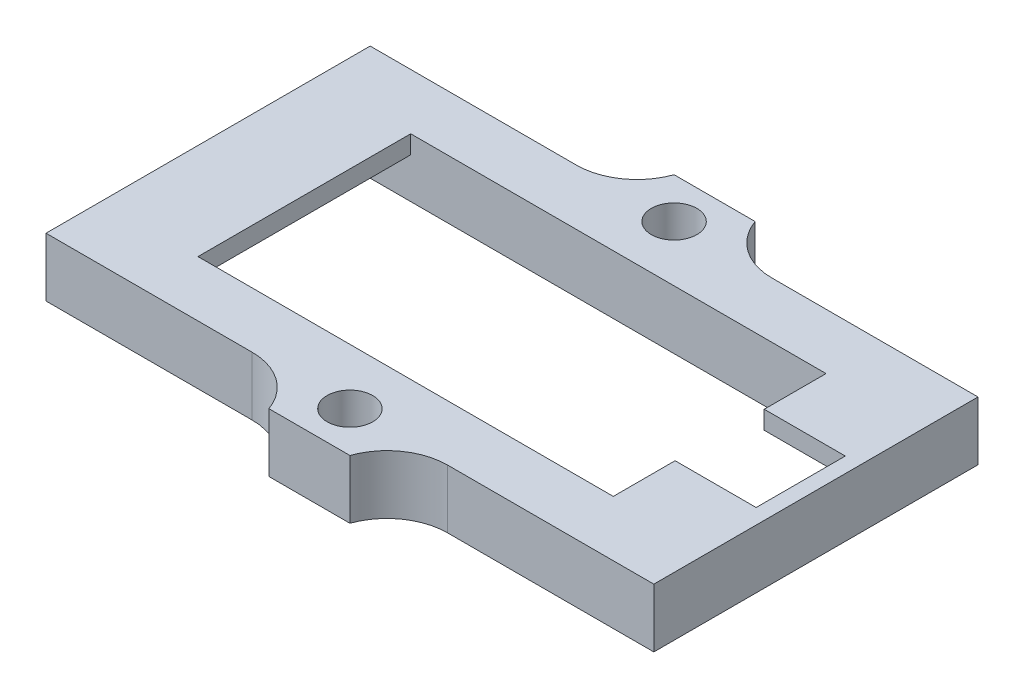
ISO-10303-21;
HEADER;
FILE_DESCRIPTION(('STEP AP214'),'2;1');
FILE_NAME('part.step','',(''),(''),'','','');
FILE_SCHEMA(('AUTOMOTIVE_DESIGN { 1 0 10303 214 1 1 1 1 }'));
ENDSEC;
DATA;
#1=APPLICATION_CONTEXT('core data for automotive mechanical design processes');
#2=APPLICATION_PROTOCOL_DEFINITION('international standard','automotive_design',2000,#1);
#3=PRODUCT_CONTEXT('',#1,'mechanical');
#4=PRODUCT('Part','Part','',(#3));
#5=PRODUCT_RELATED_PRODUCT_CATEGORY('part','',(#4));
#6=PRODUCT_DEFINITION_FORMATION('','',#4);
#7=PRODUCT_DEFINITION_CONTEXT('part definition',#1,'design');
#8=PRODUCT_DEFINITION('design','',#6,#7);
#9=PRODUCT_DEFINITION_SHAPE('','',#8);
#10=(LENGTH_UNIT() NAMED_UNIT(*) SI_UNIT(.MILLI.,.METRE.));
#11=(NAMED_UNIT(*) PLANE_ANGLE_UNIT() SI_UNIT($,.RADIAN.));
#12=(NAMED_UNIT(*) SI_UNIT($,.STERADIAN.) SOLID_ANGLE_UNIT());
#13=UNCERTAINTY_MEASURE_WITH_UNIT(LENGTH_MEASURE(1.E-05),#10,'distance_accuracy_value','');
#14=(GEOMETRIC_REPRESENTATION_CONTEXT(3) GLOBAL_UNCERTAINTY_ASSIGNED_CONTEXT((#13)) GLOBAL_UNIT_ASSIGNED_CONTEXT((#10,
#11,#12)) REPRESENTATION_CONTEXT('',''));
#15=CARTESIAN_POINT('',(0.,0.,0.));
#16=DIRECTION('',(0.,0.,1.));
#17=DIRECTION('',(1.,0.,0.));
#18=AXIS2_PLACEMENT_3D('',#15,#16,#17);
#19=CARTESIAN_POINT('',(20.5,0.,10.5));
#20=DIRECTION('',(1.,0.,0.));
#21=DIRECTION('',(0.,0.,-1.));
#22=AXIS2_PLACEMENT_3D('',#19,#20,#21);
#23=PLANE('',#22);
#24=DIRECTION('',(0.,0.,1.));
#25=VECTOR('',#24,1.);
#26=CARTESIAN_POINT('',(20.5,4.,10.5));
#27=LINE('',#26,#25);
#28=CARTESIAN_POINT('',(20.5,4.,-10.5));
#29=VERTEX_POINT('',#28);
#30=CARTESIAN_POINT('',(20.5,4.,-4.4));
#31=VERTEX_POINT('',#30);
#32=EDGE_CURVE('E271',#29,#31,#27,.T.);
#33=ORIENTED_EDGE('',*,*,#32,.T.);
#34=DIRECTION('',(0.,1.,0.));
#35=VECTOR('',#34,1.);
#36=CARTESIAN_POINT('',(20.5,0.,-4.4));
#37=LINE('',#36,#35);
#38=CARTESIAN_POINT('',(20.5,5.8,-4.4));
#39=VERTEX_POINT('',#38);
#40=EDGE_CURVE('E500',#31,#39,#37,.T.);
#41=ORIENTED_EDGE('',*,*,#40,.T.);
#42=DIRECTION('',(0.,0.,-1.));
#43=VECTOR('',#42,1.);
#44=CARTESIAN_POINT('',(20.5,5.8,10.5));
#45=LINE('',#44,#43);
#46=CARTESIAN_POINT('',(20.5,5.8,-10.5));
#47=VERTEX_POINT('',#46);
#48=EDGE_CURVE('E275',#39,#47,#45,.T.);
#49=ORIENTED_EDGE('',*,*,#48,.T.);
#50=DIRECTION('',(0.,1.,0.));
#51=VECTOR('',#50,1.);
#52=CARTESIAN_POINT('',(20.5,0.,-10.5));
#53=LINE('',#52,#51);
#54=EDGE_CURVE('E283',#29,#47,#53,.T.);
#55=ORIENTED_EDGE('',*,*,#54,.F.);
#56=EDGE_LOOP('',(#33,#41,#49,#55));
#57=FACE_BOUND('',#56,.T.);
#58=ADVANCED_FACE('F40',(#57),#23,.F.);
#59=CARTESIAN_POINT('',(0.,4.,0.));
#60=DIRECTION('',(0.,1.,0.));
#61=DIRECTION('',(0.,0.,1.));
#62=AXIS2_PLACEMENT_3D('',#59,#60,#61);
#63=PLANE('',#62);
#64=DIRECTION('',(0.,0.,1.));
#65=VECTOR('',#64,1.);
#66=CARTESIAN_POINT('',(28.5,4.,-10.5));
#67=LINE('',#66,#65);
#68=CARTESIAN_POINT('',(28.5,4.,-10.5));
#69=VERTEX_POINT('',#68);
#70=CARTESIAN_POINT('',(28.5,4.,-4.4));
#71=VERTEX_POINT('',#70);
#72=EDGE_CURVE('E226',#69,#71,#67,.T.);
#73=ORIENTED_EDGE('',*,*,#72,.T.);
#74=DIRECTION('',(1.,0.,0.));
#75=VECTOR('',#74,1.);
#76=CARTESIAN_POINT('',(12.5,4.,-4.4));
#77=LINE('',#76,#75);
#78=EDGE_CURVE('E56',#31,#71,#77,.T.);
#79=ORIENTED_EDGE('',*,*,#78,.F.);
#80=ORIENTED_EDGE('',*,*,#32,.F.);
#81=DIRECTION('',(1.,0.,0.));
#82=VECTOR('',#81,1.);
#83=CARTESIAN_POINT('',(-28.5,4.,-10.5));
#84=LINE('',#83,#82);
#85=EDGE_CURVE('E247',#29,#69,#84,.T.);
#86=ORIENTED_EDGE('',*,*,#85,.T.);
#87=EDGE_LOOP('',(#73,#79,#80,#86));
#88=FACE_BOUND('',#87,.T.);
#89=ADVANCED_FACE('F517',(#88),#63,.F.);
#90=CARTESIAN_POINT('',(0.,5.8,16.));
#91=DIRECTION('',(0.,0.,-1.));
#92=DIRECTION('',(-1.,0.,0.));
#93=AXIS2_PLACEMENT_3D('',#90,#91,#92);
#94=PLANE('',#93);
#95=DIRECTION('',(1.,0.,0.));
#96=VECTOR('',#95,1.);
#97=CARTESIAN_POINT('',(0.,0.,16.));
#98=LINE('',#97,#96);
#99=CARTESIAN_POINT('',(-30.,0.,16.));
#100=VERTEX_POINT('',#99);
#101=CARTESIAN_POINT('',(-9.65685424949239,0.,16.));
#102=VERTEX_POINT('',#101);
#103=EDGE_CURVE('E349',#100,#102,#98,.T.);
#104=ORIENTED_EDGE('',*,*,#103,.T.);
#105=DIRECTION('',(0.,1.,0.));
#106=VECTOR('',#105,1.);
#107=CARTESIAN_POINT('',(-9.65685424949239,5.8,16.));
#108=LINE('',#107,#106);
#109=CARTESIAN_POINT('',(-9.65685424949239,5.8,16.));
#110=VERTEX_POINT('',#109);
#111=EDGE_CURVE('E413',#102,#110,#108,.T.);
#112=ORIENTED_EDGE('',*,*,#111,.T.);
#113=DIRECTION('',(1.,0.,0.));
#114=VECTOR('',#113,1.);
#115=CARTESIAN_POINT('',(0.,5.8,16.));
#116=LINE('',#115,#114);
#117=CARTESIAN_POINT('',(-30.,5.8,16.));
#118=VERTEX_POINT('',#117);
#119=EDGE_CURVE('E316',#118,#110,#116,.T.);
#120=ORIENTED_EDGE('',*,*,#119,.F.);
#121=DIRECTION('',(0.,-1.,0.));
#122=VECTOR('',#121,1.);
#123=CARTESIAN_POINT('',(-30.,5.8,16.));
#124=LINE('',#123,#122);
#125=EDGE_CURVE('E345',#118,#100,#124,.T.);
#126=ORIENTED_EDGE('',*,*,#125,.T.);
#127=EDGE_LOOP('',(#104,#112,#120,#126));
#128=FACE_BOUND('',#127,.T.);
#129=ADVANCED_FACE('F551',(#128),#94,.F.);
#130=CARTESIAN_POINT('',(0.,5.8,20.));
#131=DIRECTION('',(0.,0.,-1.));
#132=DIRECTION('',(-1.,0.,0.));
#133=AXIS2_PLACEMENT_3D('',#130,#131,#132);
#134=PLANE('',#133);
#135=DIRECTION('',(1.,0.,0.));
#136=VECTOR('',#135,1.);
#137=CARTESIAN_POINT('',(0.,0.,20.));
#138=LINE('',#137,#136);
#139=CARTESIAN_POINT('',(-4.00000000000001,0.,20.));
#140=VERTEX_POINT('',#139);
#141=CARTESIAN_POINT('',(3.99999999999999,0.,20.));
#142=VERTEX_POINT('',#141);
#143=EDGE_CURVE('E353',#140,#142,#138,.T.);
#144=ORIENTED_EDGE('',*,*,#143,.T.);
#145=DIRECTION('',(0.,-1.,0.));
#146=VECTOR('',#145,1.);
#147=CARTESIAN_POINT('',(3.99999999999999,5.8,20.));
#148=LINE('',#147,#146);
#149=CARTESIAN_POINT('',(3.99999999999999,5.8,20.));
#150=VERTEX_POINT('',#149);
#151=EDGE_CURVE('E398',#150,#142,#148,.T.);
#152=ORIENTED_EDGE('',*,*,#151,.F.);
#153=DIRECTION('',(1.,0.,0.));
#154=VECTOR('',#153,1.);
#155=CARTESIAN_POINT('',(0.,5.8,20.));
#156=LINE('',#155,#154);
#157=CARTESIAN_POINT('',(-4.00000000000001,5.8,20.));
#158=VERTEX_POINT('',#157);
#159=EDGE_CURVE('E321',#158,#150,#156,.T.);
#160=ORIENTED_EDGE('',*,*,#159,.F.);
#161=DIRECTION('',(0.,-1.,0.));
#162=VECTOR('',#161,1.);
#163=CARTESIAN_POINT('',(-4.00000000000001,5.8,20.));
#164=LINE('',#163,#162);
#165=EDGE_CURVE('E402',#158,#140,#164,.T.);
#166=ORIENTED_EDGE('',*,*,#165,.T.);
#167=EDGE_LOOP('',(#144,#152,#160,#166));
#168=FACE_BOUND('',#167,.T.);
#169=ADVANCED_FACE('F449',(#168),#134,.F.);
#170=CARTESIAN_POINT('',(9.65685424949237,5.8,16.));
#171=VERTEX_POINT('',#170);
#172=CARTESIAN_POINT('',(30.,5.8,16.));
#173=VERTEX_POINT('',#172);
#174=EDGE_CURVE('E322',#171,#173,#116,.T.);
#175=ORIENTED_EDGE('',*,*,#174,.F.);
#176=DIRECTION('',(0.,1.,0.));
#177=VECTOR('',#176,1.);
#178=CARTESIAN_POINT('',(9.65685424949237,5.8,16.));
#179=LINE('',#178,#177);
#180=CARTESIAN_POINT('',(9.65685424949237,0.,16.));
#181=VERTEX_POINT('',#180);
#182=EDGE_CURVE('E416',#171,#181,#179,.F.);
#183=ORIENTED_EDGE('',*,*,#182,.T.);
#184=CARTESIAN_POINT('',(30.,0.,16.));
#185=VERTEX_POINT('',#184);
#186=EDGE_CURVE('E354',#181,#185,#98,.T.);
#187=ORIENTED_EDGE('',*,*,#186,.T.);
#188=DIRECTION('',(0.,-1.,0.));
#189=VECTOR('',#188,1.);
#190=CARTESIAN_POINT('',(30.,5.8,16.));
#191=LINE('',#190,#189);
#192=EDGE_CURVE('E394',#173,#185,#191,.T.);
#193=ORIENTED_EDGE('',*,*,#192,.F.);
#194=EDGE_LOOP('',(#175,#183,#187,#193));
#195=FACE_BOUND('',#194,.T.);
#196=ADVANCED_FACE('F459',(#195),#94,.F.);
#197=CARTESIAN_POINT('',(30.,5.8,0.));
#198=DIRECTION('',(-1.,0.,0.));
#199=DIRECTION('',(0.,0.,1.));
#200=AXIS2_PLACEMENT_3D('',#197,#198,#199);
#201=PLANE('',#200);
#202=DIRECTION('',(0.,0.,-1.));
#203=VECTOR('',#202,1.);
#204=CARTESIAN_POINT('',(30.,0.,0.));
#205=LINE('',#204,#203);
#206=CARTESIAN_POINT('',(30.,0.,-16.));
#207=VERTEX_POINT('',#206);
#208=EDGE_CURVE('E358',#185,#207,#205,.T.);
#209=ORIENTED_EDGE('',*,*,#208,.T.);
#210=DIRECTION('',(0.,-1.,0.));
#211=VECTOR('',#210,1.);
#212=CARTESIAN_POINT('',(30.,5.8,-16.));
#213=LINE('',#212,#211);
#214=CARTESIAN_POINT('',(30.,5.8,-16.));
#215=VERTEX_POINT('',#214);
#216=EDGE_CURVE('E390',#215,#207,#213,.T.);
#217=ORIENTED_EDGE('',*,*,#216,.F.);
#218=DIRECTION('',(0.,0.,-1.));
#219=VECTOR('',#218,1.);
#220=CARTESIAN_POINT('',(30.,5.8,0.));
#221=LINE('',#220,#219);
#222=EDGE_CURVE('E325',#173,#215,#221,.T.);
#223=ORIENTED_EDGE('',*,*,#222,.F.);
#224=ORIENTED_EDGE('',*,*,#192,.T.);
#225=EDGE_LOOP('',(#209,#217,#223,#224));
#226=FACE_BOUND('',#225,.T.);
#227=ADVANCED_FACE('F612',(#226),#201,.F.);
#228=CARTESIAN_POINT('',(0.,5.8,-16.));
#229=DIRECTION('',(0.,0.,-1.));
#230=DIRECTION('',(-1.,0.,0.));
#231=AXIS2_PLACEMENT_3D('',#228,#229,#230);
#232=PLANE('',#231);
#233=DIRECTION('',(1.,0.,0.));
#234=VECTOR('',#233,1.);
#235=CARTESIAN_POINT('',(0.,0.,-16.));
#236=LINE('',#235,#234);
#237=CARTESIAN_POINT('',(9.65685424949238,0.,-16.));
#238=VERTEX_POINT('',#237);
#239=EDGE_CURVE('E362',#238,#207,#236,.T.);
#240=ORIENTED_EDGE('',*,*,#239,.F.);
#241=DIRECTION('',(0.,1.,0.));
#242=VECTOR('',#241,1.);
#243=CARTESIAN_POINT('',(9.65685424949238,5.8,-16.));
#244=LINE('',#243,#242);
#245=CARTESIAN_POINT('',(9.65685424949238,5.8,-16.));
#246=VERTEX_POINT('',#245);
#247=EDGE_CURVE('E406',#238,#246,#244,.T.);
#248=ORIENTED_EDGE('',*,*,#247,.T.);
#249=DIRECTION('',(1.,0.,0.));
#250=VECTOR('',#249,1.);
#251=CARTESIAN_POINT('',(0.,5.8,-16.));
#252=LINE('',#251,#250);
#253=EDGE_CURVE('E329',#246,#215,#252,.T.);
#254=ORIENTED_EDGE('',*,*,#253,.T.);
#255=ORIENTED_EDGE('',*,*,#216,.T.);
#256=EDGE_LOOP('',(#240,#248,#254,#255));
#257=FACE_BOUND('',#256,.T.);
#258=ADVANCED_FACE('F609',(#257),#232,.T.);
#259=CARTESIAN_POINT('',(0.,5.8,-20.));
#260=DIRECTION('',(0.,0.,-1.));
#261=DIRECTION('',(-1.,0.,0.));
#262=AXIS2_PLACEMENT_3D('',#259,#260,#261);
#263=PLANE('',#262);
#264=DIRECTION('',(1.,0.,0.));
#265=VECTOR('',#264,1.);
#266=CARTESIAN_POINT('',(0.,0.,-20.));
#267=LINE('',#266,#265);
#268=CARTESIAN_POINT('',(-4.00000000000001,0.,-20.));
#269=VERTEX_POINT('',#268);
#270=CARTESIAN_POINT('',(3.99999999999999,0.,-20.));
#271=VERTEX_POINT('',#270);
#272=EDGE_CURVE('E365',#269,#271,#267,.T.);
#273=ORIENTED_EDGE('',*,*,#272,.F.);
#274=DIRECTION('',(0.,-1.,0.));
#275=VECTOR('',#274,1.);
#276=CARTESIAN_POINT('',(-4.00000000000001,5.8,-20.));
#277=LINE('',#276,#275);
#278=CARTESIAN_POINT('',(-4.00000000000001,5.8,-20.));
#279=VERTEX_POINT('',#278);
#280=EDGE_CURVE('E382',#279,#269,#277,.T.);
#281=ORIENTED_EDGE('',*,*,#280,.F.);
#282=DIRECTION('',(1.,0.,0.));
#283=VECTOR('',#282,1.);
#284=CARTESIAN_POINT('',(0.,5.8,-20.));
#285=LINE('',#284,#283);
#286=CARTESIAN_POINT('',(3.99999999999999,5.8,-20.));
#287=VERTEX_POINT('',#286);
#288=EDGE_CURVE('E332',#279,#287,#285,.T.);
#289=ORIENTED_EDGE('',*,*,#288,.T.);
#290=DIRECTION('',(0.,-1.,0.));
#291=VECTOR('',#290,1.);
#292=CARTESIAN_POINT('',(3.99999999999999,5.8,-20.));
#293=LINE('',#292,#291);
#294=EDGE_CURVE('E386',#287,#271,#293,.T.);
#295=ORIENTED_EDGE('',*,*,#294,.T.);
#296=EDGE_LOOP('',(#273,#281,#289,#295));
#297=FACE_BOUND('',#296,.T.);
#298=ADVANCED_FACE('F600',(#297),#263,.T.);
#299=CARTESIAN_POINT('',(-30.,5.8,-16.));
#300=VERTEX_POINT('',#299);
#301=CARTESIAN_POINT('',(-9.65685424949239,5.8,-16.));
#302=VERTEX_POINT('',#301);
#303=EDGE_CURVE('E333',#300,#302,#252,.T.);
#304=ORIENTED_EDGE('',*,*,#303,.T.);
#305=DIRECTION('',(0.,1.,0.));
#306=VECTOR('',#305,1.);
#307=CARTESIAN_POINT('',(-9.65685424949239,0.,-16.));
#308=LINE('',#307,#306);
#309=CARTESIAN_POINT('',(-9.65685424949239,0.,-16.));
#310=VERTEX_POINT('',#309);
#311=EDGE_CURVE('E409',#302,#310,#308,.F.);
#312=ORIENTED_EDGE('',*,*,#311,.T.);
#313=CARTESIAN_POINT('',(-30.,0.,-16.));
#314=VERTEX_POINT('',#313);
#315=EDGE_CURVE('E366',#314,#310,#236,.T.);
#316=ORIENTED_EDGE('',*,*,#315,.F.);
#317=DIRECTION('',(0.,-1.,0.));
#318=VECTOR('',#317,1.);
#319=CARTESIAN_POINT('',(-30.,5.8,-16.));
#320=LINE('',#319,#318);
#321=EDGE_CURVE('E379',#300,#314,#320,.T.);
#322=ORIENTED_EDGE('',*,*,#321,.F.);
#323=EDGE_LOOP('',(#304,#312,#316,#322));
#324=FACE_BOUND('',#323,.T.);
#325=ADVANCED_FACE('F539',(#324),#232,.T.);
#326=CARTESIAN_POINT('',(-30.,5.8,0.));
#327=DIRECTION('',(-1.,0.,0.));
#328=DIRECTION('',(0.,0.,1.));
#329=AXIS2_PLACEMENT_3D('',#326,#327,#328);
#330=PLANE('',#329);
#331=DIRECTION('',(0.,0.,-1.));
#332=VECTOR('',#331,1.);
#333=CARTESIAN_POINT('',(-30.,0.,0.));
#334=LINE('',#333,#332);
#335=EDGE_CURVE('E370',#100,#314,#334,.T.);
#336=ORIENTED_EDGE('',*,*,#335,.F.);
#337=ORIENTED_EDGE('',*,*,#125,.F.);
#338=DIRECTION('',(0.,0.,-1.));
#339=VECTOR('',#338,1.);
#340=CARTESIAN_POINT('',(-30.,5.8,0.));
#341=LINE('',#340,#339);
#342=EDGE_CURVE('E337',#118,#300,#341,.T.);
#343=ORIENTED_EDGE('',*,*,#342,.T.);
#344=ORIENTED_EDGE('',*,*,#321,.T.);
#345=EDGE_LOOP('',(#336,#337,#343,#344));
#346=FACE_BOUND('',#345,.T.);
#347=ADVANCED_FACE('F530',(#346),#330,.T.);
#348=CARTESIAN_POINT('',(0.,5.8,16.));
#349=DIRECTION('',(0.,-1.,0.));
#350=DIRECTION('',(0.,0.,-1.));
#351=AXIS2_PLACEMENT_3D('',#348,#349,#350);
#352=CYLINDRICAL_SURFACE('',#351,2.24999999999998);
#353=CARTESIAN_POINT('',(0.,5.8,16.));
#354=DIRECTION('',(0.,1.,0.));
#355=DIRECTION('',(0.,0.,1.));
#356=AXIS2_PLACEMENT_3D('',#353,#354,#355);
#357=CIRCLE('',#356,2.24999999999998);
#358=CARTESIAN_POINT('',(0.,5.8,18.25));
#359=VERTEX_POINT('',#358);
#360=EDGE_CURVE('E312',#359,#359,#357,.F.);
#361=ORIENTED_EDGE('',*,*,#360,.F.);
#362=EDGE_LOOP('',(#361));
#363=FACE_BOUND('',#362,.T.);
#364=CARTESIAN_POINT('',(0.,0.,16.));
#365=DIRECTION('',(0.,1.,0.));
#366=DIRECTION('',(0.,0.,1.));
#367=AXIS2_PLACEMENT_3D('',#364,#365,#366);
#368=CIRCLE('',#367,2.24999999999998);
#369=CARTESIAN_POINT('',(0.,0.,18.25));
#370=VERTEX_POINT('',#369);
#371=EDGE_CURVE('E302',#370,#370,#368,.F.);
#372=ORIENTED_EDGE('',*,*,#371,.T.);
#373=EDGE_LOOP('',(#372));
#374=FACE_BOUND('',#373,.T.);
#375=ADVANCED_FACE('F527',(#363,#374),#352,.F.);
#376=CARTESIAN_POINT('',(0.,5.8,-16.));
#377=DIRECTION('',(0.,-1.,0.));
#378=DIRECTION('',(0.,0.,-1.));
#379=AXIS2_PLACEMENT_3D('',#376,#377,#378);
#380=CYLINDRICAL_SURFACE('',#379,2.25);
#381=CARTESIAN_POINT('',(0.,5.8,-16.));
#382=DIRECTION('',(0.,1.,0.));
#383=DIRECTION('',(0.,0.,1.));
#384=AXIS2_PLACEMENT_3D('',#381,#382,#383);
#385=CIRCLE('',#384,2.25);
#386=CARTESIAN_POINT('',(0.,5.8,-13.75));
#387=VERTEX_POINT('',#386);
#388=EDGE_CURVE('E341',#387,#387,#385,.T.);
#389=ORIENTED_EDGE('',*,*,#388,.T.);
#390=EDGE_LOOP('',(#389));
#391=FACE_BOUND('',#390,.T.);
#392=CARTESIAN_POINT('',(0.,0.,-16.));
#393=DIRECTION('',(0.,1.,0.));
#394=DIRECTION('',(0.,0.,1.));
#395=AXIS2_PLACEMENT_3D('',#392,#393,#394);
#396=CIRCLE('',#395,2.25);
#397=CARTESIAN_POINT('',(0.,0.,-13.75));
#398=VERTEX_POINT('',#397);
#399=EDGE_CURVE('E317',#398,#398,#396,.T.);
#400=ORIENTED_EDGE('',*,*,#399,.F.);
#401=EDGE_LOOP('',(#400));
#402=FACE_BOUND('',#401,.T.);
#403=ADVANCED_FACE('F529',(#391,#402),#380,.F.);
#404=CARTESIAN_POINT('',(0.,5.8,0.));
#405=DIRECTION('',(0.,1.,0.));
#406=DIRECTION('',(0.,0.,1.));
#407=AXIS2_PLACEMENT_3D('',#404,#405,#406);
#408=PLANE('',#407);
#409=DIRECTION('',(-1.,0.,0.));
#410=VECTOR('',#409,1.);
#411=CARTESIAN_POINT('',(0.,5.8,-4.4));
#412=LINE('',#411,#410);
#413=CARTESIAN_POINT('',(28.5,5.8,-4.4));
#414=VERTEX_POINT('',#413);
#415=EDGE_CURVE('E506',#414,#39,#412,.T.);
#416=ORIENTED_EDGE('',*,*,#415,.F.);
#417=DIRECTION('',(0.,0.,-1.));
#418=VECTOR('',#417,1.);
#419=CARTESIAN_POINT('',(28.5,5.8,0.));
#420=LINE('',#419,#418);
#421=CARTESIAN_POINT('',(28.5,5.8,4.4));
#422=VERTEX_POINT('',#421);
#423=EDGE_CURVE('E238',#422,#414,#420,.T.);
#424=ORIENTED_EDGE('',*,*,#423,.F.);
#425=DIRECTION('',(1.,0.,0.));
#426=VECTOR('',#425,1.);
#427=CARTESIAN_POINT('',(0.,5.8,4.4));
#428=LINE('',#427,#426);
#429=CARTESIAN_POINT('',(20.5,5.8,4.4));
#430=VERTEX_POINT('',#429);
#431=EDGE_CURVE('E207',#430,#422,#428,.T.);
#432=ORIENTED_EDGE('',*,*,#431,.F.);
#433=CARTESIAN_POINT('',(20.5,5.8,10.5));
#434=VERTEX_POINT('',#433);
#435=EDGE_CURVE('E284',#434,#430,#45,.T.);
#436=ORIENTED_EDGE('',*,*,#435,.F.);
#437=DIRECTION('',(1.,0.,0.));
#438=VECTOR('',#437,1.);
#439=CARTESIAN_POINT('',(-20.5,5.8,10.5));
#440=LINE('',#439,#438);
#441=CARTESIAN_POINT('',(-20.5,5.8,10.5));
#442=VERTEX_POINT('',#441);
#443=EDGE_CURVE('E280',#442,#434,#440,.T.);
#444=ORIENTED_EDGE('',*,*,#443,.F.);
#445=DIRECTION('',(0.,0.,1.));
#446=VECTOR('',#445,1.);
#447=CARTESIAN_POINT('',(-20.5,5.8,10.5));
#448=LINE('',#447,#446);
#449=CARTESIAN_POINT('',(-20.5,5.8,-10.5));
#450=VERTEX_POINT('',#449);
#451=EDGE_CURVE('E292',#450,#442,#448,.T.);
#452=ORIENTED_EDGE('',*,*,#451,.F.);
#453=DIRECTION('',(-1.,0.,0.));
#454=VECTOR('',#453,1.);
#455=CARTESIAN_POINT('',(-20.5,5.8,-10.5));
#456=LINE('',#455,#454);
#457=EDGE_CURVE('E288',#47,#450,#456,.T.);
#458=ORIENTED_EDGE('',*,*,#457,.F.);
#459=ORIENTED_EDGE('',*,*,#48,.F.);
#460=EDGE_LOOP('',(#416,#424,#432,#436,#444,#452,#458,#459));
#461=FACE_BOUND('',#460,.T.);
#462=ORIENTED_EDGE('',*,*,#360,.T.);
#463=EDGE_LOOP('',(#462));
#464=FACE_BOUND('',#463,.T.);
#465=ORIENTED_EDGE('',*,*,#119,.T.);
#466=CARTESIAN_POINT('',(-9.65685424949239,5.8,22.));
#467=DIRECTION('',(0.,1.,0.));
#468=DIRECTION('',(0.,0.,1.));
#469=AXIS2_PLACEMENT_3D('',#466,#467,#468);
#470=CIRCLE('',#469,6.);
#471=EDGE_CURVE('E435',#110,#158,#470,.F.);
#472=ORIENTED_EDGE('',*,*,#471,.T.);
#473=ORIENTED_EDGE('',*,*,#159,.T.);
#474=CARTESIAN_POINT('',(9.65685424949237,5.8,22.));
#475=DIRECTION('',(0.,1.,0.));
#476=DIRECTION('',(0.,0.,1.));
#477=AXIS2_PLACEMENT_3D('',#474,#475,#476);
#478=CIRCLE('',#477,6.);
#479=EDGE_CURVE('E11',#150,#171,#478,.F.);
#480=ORIENTED_EDGE('',*,*,#479,.T.);
#481=ORIENTED_EDGE('',*,*,#174,.T.);
#482=ORIENTED_EDGE('',*,*,#222,.T.);
#483=ORIENTED_EDGE('',*,*,#253,.F.);
#484=CARTESIAN_POINT('',(9.65685424949238,5.8,-22.));
#485=DIRECTION('',(0.,1.,0.));
#486=DIRECTION('',(0.,0.,1.));
#487=AXIS2_PLACEMENT_3D('',#484,#485,#486);
#488=CIRCLE('',#487,6.);
#489=EDGE_CURVE('E423',#246,#287,#488,.F.);
#490=ORIENTED_EDGE('',*,*,#489,.T.);
#491=ORIENTED_EDGE('',*,*,#288,.F.);
#492=CARTESIAN_POINT('',(-9.65685424949239,5.8,-22.));
#493=DIRECTION('',(0.,1.,0.));
#494=DIRECTION('',(0.,0.,1.));
#495=AXIS2_PLACEMENT_3D('',#492,#493,#494);
#496=CIRCLE('',#495,6.);
#497=EDGE_CURVE('E429',#279,#302,#496,.F.);
#498=ORIENTED_EDGE('',*,*,#497,.T.);
#499=ORIENTED_EDGE('',*,*,#303,.F.);
#500=ORIENTED_EDGE('',*,*,#342,.F.);
#501=EDGE_LOOP('',(#465,#472,#473,#480,#481,#482,#483,#490,#491,#498,#499,#500));
#502=FACE_BOUND('',#501,.T.);
#503=ORIENTED_EDGE('',*,*,#388,.F.);
#504=EDGE_LOOP('',(#503));
#505=FACE_BOUND('',#504,.T.);
#506=ADVANCED_FACE('F455',(#461,#464,#502,#505),#408,.T.);
#507=CARTESIAN_POINT('',(0.,0.,0.));
#508=DIRECTION('',(0.,1.,0.));
#509=DIRECTION('',(0.,0.,1.));
#510=AXIS2_PLACEMENT_3D('',#507,#508,#509);
#511=PLANE('',#510);
#512=DIRECTION('',(-1.,0.,0.));
#513=VECTOR('',#512,1.);
#514=CARTESIAN_POINT('',(-20.5,0.,-10.5));
#515=LINE('',#514,#513);
#516=CARTESIAN_POINT('',(28.5,0.,-10.5));
#517=VERTEX_POINT('',#516);
#518=CARTESIAN_POINT('',(-28.5,0.,-10.5));
#519=VERTEX_POINT('',#518);
#520=EDGE_CURVE('E276',#517,#519,#515,.T.);
#521=ORIENTED_EDGE('',*,*,#520,.T.);
#522=DIRECTION('',(0.,0.,-1.));
#523=VECTOR('',#522,1.);
#524=CARTESIAN_POINT('',(-28.5,0.,-10.5));
#525=LINE('',#524,#523);
#526=CARTESIAN_POINT('',(-28.5,0.,10.5));
#527=VERTEX_POINT('',#526);
#528=EDGE_CURVE('E227',#527,#519,#525,.T.);
#529=ORIENTED_EDGE('',*,*,#528,.F.);
#530=DIRECTION('',(1.,0.,0.));
#531=VECTOR('',#530,1.);
#532=CARTESIAN_POINT('',(-20.5,0.,10.5));
#533=LINE('',#532,#531);
#534=CARTESIAN_POINT('',(28.5,0.,10.5));
#535=VERTEX_POINT('',#534);
#536=EDGE_CURVE('E279',#527,#535,#533,.T.);
#537=ORIENTED_EDGE('',*,*,#536,.T.);
#538=DIRECTION('',(0.,0.,1.));
#539=VECTOR('',#538,1.);
#540=CARTESIAN_POINT('',(28.5,0.,-10.5));
#541=LINE('',#540,#539);
#542=EDGE_CURVE('E234',#517,#535,#541,.T.);
#543=ORIENTED_EDGE('',*,*,#542,.F.);
#544=EDGE_LOOP('',(#521,#529,#537,#543));
#545=FACE_BOUND('',#544,.T.);
#546=ORIENTED_EDGE('',*,*,#371,.F.);
#547=EDGE_LOOP('',(#546));
#548=FACE_BOUND('',#547,.T.);
#549=ORIENTED_EDGE('',*,*,#103,.F.);
#550=ORIENTED_EDGE('',*,*,#335,.T.);
#551=ORIENTED_EDGE('',*,*,#315,.T.);
#552=CARTESIAN_POINT('',(-9.65685424949239,0.,-22.));
#553=DIRECTION('',(0.,1.,0.));
#554=DIRECTION('',(0.,0.,1.));
#555=AXIS2_PLACEMENT_3D('',#552,#553,#554);
#556=CIRCLE('',#555,6.);
#557=EDGE_CURVE('E426',#310,#269,#556,.T.);
#558=ORIENTED_EDGE('',*,*,#557,.T.);
#559=ORIENTED_EDGE('',*,*,#272,.T.);
#560=CARTESIAN_POINT('',(9.65685424949238,0.,-22.));
#561=DIRECTION('',(0.,1.,0.));
#562=DIRECTION('',(0.,0.,1.));
#563=AXIS2_PLACEMENT_3D('',#560,#561,#562);
#564=CIRCLE('',#563,6.);
#565=EDGE_CURVE('E420',#271,#238,#564,.T.);
#566=ORIENTED_EDGE('',*,*,#565,.T.);
#567=ORIENTED_EDGE('',*,*,#239,.T.);
#568=ORIENTED_EDGE('',*,*,#208,.F.);
#569=ORIENTED_EDGE('',*,*,#186,.F.);
#570=CARTESIAN_POINT('',(9.65685424949237,0.,22.));
#571=DIRECTION('',(0.,1.,0.));
#572=DIRECTION('',(0.,0.,1.));
#573=AXIS2_PLACEMENT_3D('',#570,#571,#572);
#574=CIRCLE('',#573,6.);
#575=EDGE_CURVE('E49',#181,#142,#574,.T.);
#576=ORIENTED_EDGE('',*,*,#575,.T.);
#577=ORIENTED_EDGE('',*,*,#143,.F.);
#578=CARTESIAN_POINT('',(-9.65685424949239,0.,22.));
#579=DIRECTION('',(0.,1.,0.));
#580=DIRECTION('',(0.,0.,1.));
#581=AXIS2_PLACEMENT_3D('',#578,#579,#580);
#582=CIRCLE('',#581,6.);
#583=EDGE_CURVE('E432',#140,#102,#582,.T.);
#584=ORIENTED_EDGE('',*,*,#583,.T.);
#585=EDGE_LOOP('',(#549,#550,#551,#558,#559,#566,#567,#568,#569,#576,#577,#584));
#586=FACE_BOUND('',#585,.T.);
#587=ORIENTED_EDGE('',*,*,#399,.T.);
#588=EDGE_LOOP('',(#587));
#589=FACE_BOUND('',#588,.T.);
#590=ADVANCED_FACE('F442',(#545,#548,#586,#589),#511,.F.);
#591=ORIENTED_EDGE('',*,*,#435,.T.);
#592=DIRECTION('',(0.,-1.,0.));
#593=VECTOR('',#592,1.);
#594=CARTESIAN_POINT('',(20.5,0.,4.4));
#595=LINE('',#594,#593);
#596=CARTESIAN_POINT('',(20.5,4.,4.4));
#597=VERTEX_POINT('',#596);
#598=EDGE_CURVE('E495',#430,#597,#595,.T.);
#599=ORIENTED_EDGE('',*,*,#598,.T.);
#600=CARTESIAN_POINT('',(20.5,4.,10.5));
#601=VERTEX_POINT('',#600);
#602=EDGE_CURVE('E64',#597,#601,#27,.T.);
#603=ORIENTED_EDGE('',*,*,#602,.T.);
#604=DIRECTION('',(0.,1.,0.));
#605=VECTOR('',#604,1.);
#606=CARTESIAN_POINT('',(20.5,0.,10.5));
#607=LINE('',#606,#605);
#608=EDGE_CURVE('E299',#601,#434,#607,.T.);
#609=ORIENTED_EDGE('',*,*,#608,.T.);
#610=EDGE_LOOP('',(#591,#599,#603,#609));
#611=FACE_BOUND('',#610,.T.);
#612=ADVANCED_FACE('F494',(#611),#23,.F.);
#613=CARTESIAN_POINT('',(-20.5,0.,10.5));
#614=DIRECTION('',(0.,0.,1.));
#615=DIRECTION('',(1.,0.,0.));
#616=AXIS2_PLACEMENT_3D('',#613,#614,#615);
#617=PLANE('',#616);
#618=ORIENTED_EDGE('',*,*,#608,.F.);
#619=DIRECTION('',(-1.,0.,0.));
#620=VECTOR('',#619,1.);
#621=CARTESIAN_POINT('',(-28.5,4.,10.5));
#622=LINE('',#621,#620);
#623=CARTESIAN_POINT('',(28.5,4.,10.5));
#624=VERTEX_POINT('',#623);
#625=EDGE_CURVE('E240',#624,#601,#622,.T.);
#626=ORIENTED_EDGE('',*,*,#625,.F.);
#627=DIRECTION('',(0.,-1.,0.));
#628=VECTOR('',#627,1.);
#629=CARTESIAN_POINT('',(28.5,4.,10.5));
#630=LINE('',#629,#628);
#631=EDGE_CURVE('E223',#624,#535,#630,.T.);
#632=ORIENTED_EDGE('',*,*,#631,.T.);
#633=ORIENTED_EDGE('',*,*,#536,.F.);
#634=DIRECTION('',(0.,-1.,0.));
#635=VECTOR('',#634,1.);
#636=CARTESIAN_POINT('',(-28.5,4.,10.5));
#637=LINE('',#636,#635);
#638=CARTESIAN_POINT('',(-28.5,4.,10.5));
#639=VERTEX_POINT('',#638);
#640=EDGE_CURVE('E262',#639,#527,#637,.T.);
#641=ORIENTED_EDGE('',*,*,#640,.F.);
#642=CARTESIAN_POINT('',(-20.5,4.,10.5));
#643=VERTEX_POINT('',#642);
#644=EDGE_CURVE('E232',#643,#639,#622,.T.);
#645=ORIENTED_EDGE('',*,*,#644,.F.);
#646=DIRECTION('',(0.,1.,0.));
#647=VECTOR('',#646,1.);
#648=CARTESIAN_POINT('',(-20.5,0.,10.5));
#649=LINE('',#648,#647);
#650=EDGE_CURVE('E303',#643,#442,#649,.T.);
#651=ORIENTED_EDGE('',*,*,#650,.T.);
#652=ORIENTED_EDGE('',*,*,#443,.T.);
#653=EDGE_LOOP('',(#618,#626,#632,#633,#641,#645,#651,#652));
#654=FACE_BOUND('',#653,.T.);
#655=ADVANCED_FACE('F478',(#654),#617,.F.);
#656=CARTESIAN_POINT('',(-20.5,0.,10.5));
#657=DIRECTION('',(-1.,0.,0.));
#658=DIRECTION('',(0.,0.,1.));
#659=AXIS2_PLACEMENT_3D('',#656,#657,#658);
#660=PLANE('',#659);
#661=ORIENTED_EDGE('',*,*,#650,.F.);
#662=DIRECTION('',(0.,0.,-1.));
#663=VECTOR('',#662,1.);
#664=CARTESIAN_POINT('',(-20.5,4.,10.5));
#665=LINE('',#664,#663);
#666=CARTESIAN_POINT('',(-20.5,4.,-10.5));
#667=VERTEX_POINT('',#666);
#668=EDGE_CURVE('E257',#643,#667,#665,.T.);
#669=ORIENTED_EDGE('',*,*,#668,.T.);
#670=DIRECTION('',(0.,1.,0.));
#671=VECTOR('',#670,1.);
#672=CARTESIAN_POINT('',(-20.5,0.,-10.5));
#673=LINE('',#672,#671);
#674=EDGE_CURVE('E306',#667,#450,#673,.T.);
#675=ORIENTED_EDGE('',*,*,#674,.T.);
#676=ORIENTED_EDGE('',*,*,#451,.T.);
#677=EDGE_LOOP('',(#661,#669,#675,#676));
#678=FACE_BOUND('',#677,.T.);
#679=ADVANCED_FACE('F487',(#678),#660,.F.);
#680=CARTESIAN_POINT('',(-20.5,0.,-10.5));
#681=DIRECTION('',(0.,0.,-1.));
#682=DIRECTION('',(-1.,0.,0.));
#683=AXIS2_PLACEMENT_3D('',#680,#681,#682);
#684=PLANE('',#683);
#685=ORIENTED_EDGE('',*,*,#674,.F.);
#686=CARTESIAN_POINT('',(-28.5,4.,-10.5));
#687=VERTEX_POINT('',#686);
#688=EDGE_CURVE('E248',#687,#667,#84,.T.);
#689=ORIENTED_EDGE('',*,*,#688,.F.);
#690=DIRECTION('',(0.,-1.,0.));
#691=VECTOR('',#690,1.);
#692=CARTESIAN_POINT('',(-28.5,4.,-10.5));
#693=LINE('',#692,#691);
#694=EDGE_CURVE('E258',#687,#519,#693,.T.);
#695=ORIENTED_EDGE('',*,*,#694,.T.);
#696=ORIENTED_EDGE('',*,*,#520,.F.);
#697=DIRECTION('',(0.,-1.,0.));
#698=VECTOR('',#697,1.);
#699=CARTESIAN_POINT('',(28.5,4.,-10.5));
#700=LINE('',#699,#698);
#701=EDGE_CURVE('E253',#69,#517,#700,.T.);
#702=ORIENTED_EDGE('',*,*,#701,.F.);
#703=ORIENTED_EDGE('',*,*,#85,.F.);
#704=ORIENTED_EDGE('',*,*,#54,.T.);
#705=ORIENTED_EDGE('',*,*,#457,.T.);
#706=EDGE_LOOP('',(#685,#689,#695,#696,#702,#703,#704,#705));
#707=FACE_BOUND('',#706,.T.);
#708=ADVANCED_FACE('F484',(#707),#684,.F.);
#709=CARTESIAN_POINT('',(9.65685424949238,5.8,-22.));
#710=DIRECTION('',(0.,-1.,0.));
#711=DIRECTION('',(0.,0.,-1.));
#712=AXIS2_PLACEMENT_3D('',#709,#710,#711);
#713=CYLINDRICAL_SURFACE('',#712,6.);
#714=ORIENTED_EDGE('',*,*,#489,.F.);
#715=ORIENTED_EDGE('',*,*,#247,.F.);
#716=ORIENTED_EDGE('',*,*,#565,.F.);
#717=ORIENTED_EDGE('',*,*,#294,.F.);
#718=EDGE_LOOP('',(#714,#715,#716,#717));
#719=FACE_BOUND('',#718,.T.);
#720=ADVANCED_FACE('F569',(#719),#713,.F.);
#721=CARTESIAN_POINT('',(-9.65685424949239,5.8,-22.));
#722=DIRECTION('',(0.,-1.,0.));
#723=DIRECTION('',(0.,0.,-1.));
#724=AXIS2_PLACEMENT_3D('',#721,#722,#723);
#725=CYLINDRICAL_SURFACE('',#724,6.);
#726=ORIENTED_EDGE('',*,*,#497,.F.);
#727=ORIENTED_EDGE('',*,*,#280,.T.);
#728=ORIENTED_EDGE('',*,*,#557,.F.);
#729=ORIENTED_EDGE('',*,*,#311,.F.);
#730=EDGE_LOOP('',(#726,#727,#728,#729));
#731=FACE_BOUND('',#730,.T.);
#732=ADVANCED_FACE('F573',(#731),#725,.F.);
#733=CARTESIAN_POINT('',(-9.65685424949239,5.8,22.));
#734=DIRECTION('',(0.,1.,0.));
#735=DIRECTION('',(0.,0.,1.));
#736=AXIS2_PLACEMENT_3D('',#733,#734,#735);
#737=CYLINDRICAL_SURFACE('',#736,6.);
#738=ORIENTED_EDGE('',*,*,#471,.F.);
#739=ORIENTED_EDGE('',*,*,#111,.F.);
#740=ORIENTED_EDGE('',*,*,#583,.F.);
#741=ORIENTED_EDGE('',*,*,#165,.F.);
#742=EDGE_LOOP('',(#738,#739,#740,#741));
#743=FACE_BOUND('',#742,.T.);
#744=ADVANCED_FACE('F578',(#743),#737,.F.);
#745=CARTESIAN_POINT('',(9.65685424949237,5.8,22.));
#746=DIRECTION('',(0.,1.,0.));
#747=DIRECTION('',(0.,0.,1.));
#748=AXIS2_PLACEMENT_3D('',#745,#746,#747);
#749=CYLINDRICAL_SURFACE('',#748,6.);
#750=ORIENTED_EDGE('',*,*,#479,.F.);
#751=ORIENTED_EDGE('',*,*,#151,.T.);
#752=ORIENTED_EDGE('',*,*,#575,.F.);
#753=ORIENTED_EDGE('',*,*,#182,.F.);
#754=EDGE_LOOP('',(#750,#751,#752,#753));
#755=FACE_BOUND('',#754,.T.);
#756=ADVANCED_FACE('F42',(#755),#749,.F.);
#757=ORIENTED_EDGE('',*,*,#644,.T.);
#758=DIRECTION('',(0.,0.,-1.));
#759=VECTOR('',#758,1.);
#760=CARTESIAN_POINT('',(-28.5,4.,-10.5));
#761=LINE('',#760,#759);
#762=EDGE_CURVE('E243',#639,#687,#761,.T.);
#763=ORIENTED_EDGE('',*,*,#762,.T.);
#764=ORIENTED_EDGE('',*,*,#688,.T.);
#765=ORIENTED_EDGE('',*,*,#668,.F.);
#766=EDGE_LOOP('',(#757,#763,#764,#765));
#767=FACE_BOUND('',#766,.T.);
#768=ADVANCED_FACE('F472',(#767),#63,.F.);
#769=CARTESIAN_POINT('',(-28.5,4.,-10.5));
#770=DIRECTION('',(-1.,0.,0.));
#771=DIRECTION('',(0.,0.,1.));
#772=AXIS2_PLACEMENT_3D('',#769,#770,#771);
#773=PLANE('',#772);
#774=ORIENTED_EDGE('',*,*,#528,.T.);
#775=ORIENTED_EDGE('',*,*,#694,.F.);
#776=ORIENTED_EDGE('',*,*,#762,.F.);
#777=ORIENTED_EDGE('',*,*,#640,.T.);
#778=EDGE_LOOP('',(#774,#775,#776,#777));
#779=FACE_BOUND('',#778,.T.);
#780=ADVANCED_FACE('F481',(#779),#773,.F.);
#781=ORIENTED_EDGE('',*,*,#602,.F.);
#782=DIRECTION('',(-1.,0.,0.));
#783=VECTOR('',#782,1.);
#784=CARTESIAN_POINT('',(12.5,4.,4.4));
#785=LINE('',#784,#783);
#786=CARTESIAN_POINT('',(28.5,4.,4.4));
#787=VERTEX_POINT('',#786);
#788=EDGE_CURVE('E205',#787,#597,#785,.T.);
#789=ORIENTED_EDGE('',*,*,#788,.F.);
#790=EDGE_CURVE('E216',#787,#624,#67,.T.);
#791=ORIENTED_EDGE('',*,*,#790,.T.);
#792=ORIENTED_EDGE('',*,*,#625,.T.);
#793=EDGE_LOOP('',(#781,#789,#791,#792));
#794=FACE_BOUND('',#793,.T.);
#795=ADVANCED_FACE('F215',(#794),#63,.F.);
#796=CARTESIAN_POINT('',(28.5,4.,-10.5));
#797=DIRECTION('',(1.,0.,0.));
#798=DIRECTION('',(0.,0.,-1.));
#799=AXIS2_PLACEMENT_3D('',#796,#797,#798);
#800=PLANE('',#799);
#801=ORIENTED_EDGE('',*,*,#542,.T.);
#802=ORIENTED_EDGE('',*,*,#631,.F.);
#803=ORIENTED_EDGE('',*,*,#790,.F.);
#804=DIRECTION('',(0.,-1.,0.));
#805=VECTOR('',#804,1.);
#806=CARTESIAN_POINT('',(28.5,14.,4.4));
#807=LINE('',#806,#805);
#808=EDGE_CURVE('E202',#422,#787,#807,.T.);
#809=ORIENTED_EDGE('',*,*,#808,.F.);
#810=ORIENTED_EDGE('',*,*,#423,.T.);
#811=DIRECTION('',(0.,-1.,0.));
#812=VECTOR('',#811,1.);
#813=CARTESIAN_POINT('',(28.5,14.,-4.4));
#814=LINE('',#813,#812);
#815=EDGE_CURVE('E212',#414,#71,#814,.T.);
#816=ORIENTED_EDGE('',*,*,#815,.T.);
#817=ORIENTED_EDGE('',*,*,#72,.F.);
#818=ORIENTED_EDGE('',*,*,#701,.T.);
#819=EDGE_LOOP('',(#801,#802,#803,#809,#810,#816,#817,#818));
#820=FACE_BOUND('',#819,.T.);
#821=ADVANCED_FACE('F221',(#820),#800,.F.);
#822=CARTESIAN_POINT('',(12.5,14.,-4.4));
#823=DIRECTION('',(0.,0.,-1.));
#824=DIRECTION('',(-1.,0.,0.));
#825=AXIS2_PLACEMENT_3D('',#822,#823,#824);
#826=PLANE('',#825);
#827=ORIENTED_EDGE('',*,*,#415,.T.);
#828=ORIENTED_EDGE('',*,*,#40,.F.);
#829=ORIENTED_EDGE('',*,*,#78,.T.);
#830=ORIENTED_EDGE('',*,*,#815,.F.);
#831=EDGE_LOOP('',(#827,#828,#829,#830));
#832=FACE_BOUND('',#831,.T.);
#833=ADVANCED_FACE('F510',(#832),#826,.F.);
#834=CARTESIAN_POINT('',(12.5,14.,4.4));
#835=DIRECTION('',(0.,0.,1.));
#836=DIRECTION('',(1.,0.,0.));
#837=AXIS2_PLACEMENT_3D('',#834,#835,#836);
#838=PLANE('',#837);
#839=ORIENTED_EDGE('',*,*,#431,.T.);
#840=ORIENTED_EDGE('',*,*,#808,.T.);
#841=ORIENTED_EDGE('',*,*,#788,.T.);
#842=ORIENTED_EDGE('',*,*,#598,.F.);
#843=EDGE_LOOP('',(#839,#840,#841,#842));
#844=FACE_BOUND('',#843,.T.);
#845=ADVANCED_FACE('F204',(#844),#838,.F.);
#846=CLOSED_SHELL('',(#58,#89,#129,#169,#196,#227,#258,#298,#325,#347,#375,#403,#506,#590,#612,
#655,#679,#708,#720,#732,#744,#756,#768,#780,#795,#821,#833,#845));
#847=MANIFOLD_SOLID_BREP('B2',#846);
#848=ADVANCED_BREP_SHAPE_REPRESENTATION('',(#18,#847),#14);
#849=SHAPE_DEFINITION_REPRESENTATION(#9,#848);
ENDSEC;
END-ISO-10303-21;
